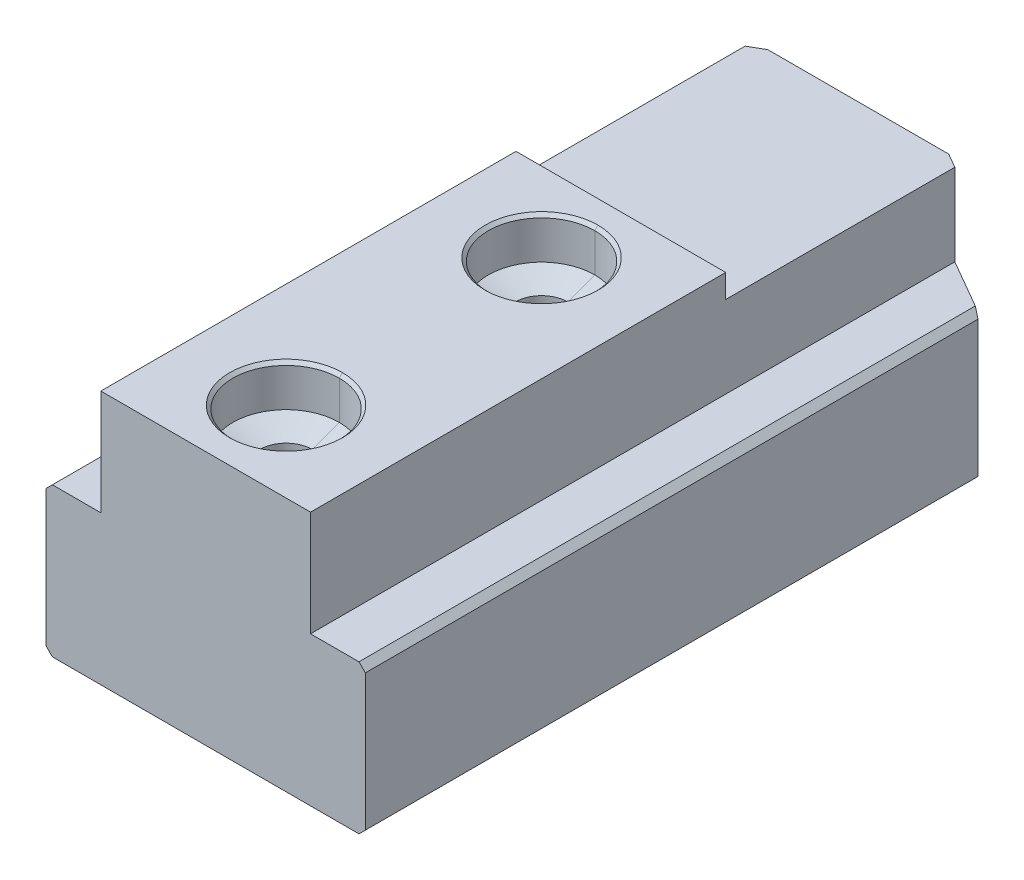
ISO-10303-21;
HEADER;
FILE_DESCRIPTION(('STEP AP214'),'2;1');
FILE_NAME('part.step','',(''),(''),'','','');
FILE_SCHEMA(('AUTOMOTIVE_DESIGN { 1 0 10303 214 1 1 1 1 }'));
ENDSEC;
DATA;
#1=APPLICATION_CONTEXT('core data for automotive mechanical design processes');
#2=APPLICATION_PROTOCOL_DEFINITION('international standard','automotive_design',2000,#1);
#3=PRODUCT_CONTEXT('',#1,'mechanical');
#4=PRODUCT('Part','Part','',(#3));
#5=PRODUCT_RELATED_PRODUCT_CATEGORY('part','',(#4));
#6=PRODUCT_DEFINITION_FORMATION('','',#4);
#7=PRODUCT_DEFINITION_CONTEXT('part definition',#1,'design');
#8=PRODUCT_DEFINITION('design','',#6,#7);
#9=PRODUCT_DEFINITION_SHAPE('','',#8);
#10=(LENGTH_UNIT() NAMED_UNIT(*) SI_UNIT(.MILLI.,.METRE.));
#11=(NAMED_UNIT(*) PLANE_ANGLE_UNIT() SI_UNIT($,.RADIAN.));
#12=(NAMED_UNIT(*) SI_UNIT($,.STERADIAN.) SOLID_ANGLE_UNIT());
#13=UNCERTAINTY_MEASURE_WITH_UNIT(LENGTH_MEASURE(1.E-05),#10,'distance_accuracy_value','');
#14=(GEOMETRIC_REPRESENTATION_CONTEXT(3) GLOBAL_UNCERTAINTY_ASSIGNED_CONTEXT((#13)) GLOBAL_UNIT_ASSIGNED_CONTEXT((#10,
#11,#12)) REPRESENTATION_CONTEXT('',''));
#15=CARTESIAN_POINT('',(0.,0.,0.));
#16=DIRECTION('',(0.,0.,1.));
#17=DIRECTION('',(1.,0.,0.));
#18=AXIS2_PLACEMENT_3D('',#15,#16,#17);
#19=CARTESIAN_POINT('',(0.,0.,0.));
#20=DIRECTION('',(0.,0.,1.));
#21=DIRECTION('',(1.,0.,0.));
#22=AXIS2_PLACEMENT_3D('',#19,#20,#21);
#23=PLANE('',#22);
#24=DIRECTION('',(0.,-1.,0.));
#25=VECTOR('',#24,1.);
#26=CARTESIAN_POINT('',(8.5,23.9,0.));
#27=LINE('',#26,#25);
#28=CARTESIAN_POINT('',(8.5,21.7,0.));
#29=VERTEX_POINT('',#28);
#30=CARTESIAN_POINT('',(8.5,0.,0.));
#31=VERTEX_POINT('',#30);
#32=EDGE_CURVE('E11',#29,#31,#27,.T.);
#33=ORIENTED_EDGE('',*,*,#32,.T.);
#34=DIRECTION('',(1.,0.,0.));
#35=VECTOR('',#34,1.);
#36=CARTESIAN_POINT('',(-14.4,0.,0.));
#37=LINE('',#36,#35);
#38=CARTESIAN_POINT('',(-8.5,0.,0.));
#39=VERTEX_POINT('',#38);
#40=EDGE_CURVE('E25',#39,#31,#37,.T.);
#41=ORIENTED_EDGE('',*,*,#40,.F.);
#42=DIRECTION('',(0.,-1.,0.));
#43=VECTOR('',#42,1.);
#44=CARTESIAN_POINT('',(-8.5,23.9,0.));
#45=LINE('',#44,#43);
#46=CARTESIAN_POINT('',(-8.5,21.7,0.));
#47=VERTEX_POINT('',#46);
#48=EDGE_CURVE('E615',#47,#39,#45,.T.);
#49=ORIENTED_EDGE('',*,*,#48,.F.);
#50=DIRECTION('',(-1.,0.,0.));
#51=VECTOR('',#50,1.);
#52=CARTESIAN_POINT('',(15.,21.7,0.));
#53=LINE('',#52,#51);
#54=EDGE_CURVE('E610',#29,#47,#53,.T.);
#55=ORIENTED_EDGE('',*,*,#54,.F.);
#56=EDGE_LOOP('',(#33,#41,#49,#55));
#57=FACE_BOUND('',#56,.T.);
#58=ADVANCED_FACE('F17',(#57),#23,.F.);
#59=CARTESIAN_POINT('',(0.,21.7,0.));
#60=DIRECTION('',(0.,1.,0.));
#61=DIRECTION('',(0.,0.,1.));
#62=AXIS2_PLACEMENT_3D('',#59,#60,#61);
#63=PLANE('',#62);
#64=DIRECTION('',(0.,0.,-1.));
#65=VECTOR('',#64,1.);
#66=CARTESIAN_POINT('',(9.85,21.7,61.3));
#67=LINE('',#66,#65);
#68=CARTESIAN_POINT('',(9.85,21.7,22.3));
#69=VERTEX_POINT('',#68);
#70=CARTESIAN_POINT('',(9.85,21.7,0.779422863406001));
#71=VERTEX_POINT('',#70);
#72=EDGE_CURVE('E606',#69,#71,#67,.T.);
#73=ORIENTED_EDGE('',*,*,#72,.T.);
#74=DIRECTION('',(-0.866025403784438,0.,-0.500000000000001));
#75=VECTOR('',#74,1.);
#76=CARTESIAN_POINT('',(2.12500000000003,21.7,-3.68060796608388));
#77=LINE('',#76,#75);
#78=EDGE_CURVE('E601',#71,#29,#77,.T.);
#79=ORIENTED_EDGE('',*,*,#78,.T.);
#80=ORIENTED_EDGE('',*,*,#54,.T.);
#81=DIRECTION('',(-0.866025403784438,0.,0.500000000000001));
#82=VECTOR('',#81,1.);
#83=CARTESIAN_POINT('',(-2.12500000000003,21.7,-3.68060796608388));
#84=LINE('',#83,#82);
#85=CARTESIAN_POINT('',(-9.85,21.7,0.77942286340601));
#86=VERTEX_POINT('',#85);
#87=EDGE_CURVE('E597',#47,#86,#84,.T.);
#88=ORIENTED_EDGE('',*,*,#87,.T.);
#89=DIRECTION('',(0.,0.,1.));
#90=VECTOR('',#89,1.);
#91=CARTESIAN_POINT('',(-9.85,21.7,61.3));
#92=LINE('',#91,#90);
#93=CARTESIAN_POINT('',(-9.85,21.7,22.3));
#94=VERTEX_POINT('',#93);
#95=EDGE_CURVE('E593',#86,#94,#92,.T.);
#96=ORIENTED_EDGE('',*,*,#95,.T.);
#97=DIRECTION('',(1.,0.,0.));
#98=VECTOR('',#97,1.);
#99=CARTESIAN_POINT('',(-15.,21.7,22.3));
#100=LINE('',#99,#98);
#101=EDGE_CURVE('E589',#94,#69,#100,.T.);
#102=ORIENTED_EDGE('',*,*,#101,.T.);
#103=EDGE_LOOP('',(#73,#79,#80,#88,#96,#102));
#104=FACE_BOUND('',#103,.T.);
#105=ADVANCED_FACE('F635',(#104),#63,.T.);
#106=CARTESIAN_POINT('',(-15.,21.7,22.3));
#107=DIRECTION('',(0.,0.,1.));
#108=DIRECTION('',(1.,0.,0.));
#109=AXIS2_PLACEMENT_3D('',#106,#107,#108);
#110=PLANE('',#109);
#111=ORIENTED_EDGE('',*,*,#101,.F.);
#112=DIRECTION('',(0.,-1.,0.));
#113=VECTOR('',#112,1.);
#114=CARTESIAN_POINT('',(-9.85,23.9,22.3));
#115=LINE('',#114,#113);
#116=CARTESIAN_POINT('',(-9.85,23.9,22.3));
#117=VERTEX_POINT('',#116);
#118=EDGE_CURVE('E584',#117,#94,#115,.T.);
#119=ORIENTED_EDGE('',*,*,#118,.F.);
#120=DIRECTION('',(1.,0.,0.));
#121=VECTOR('',#120,1.);
#122=CARTESIAN_POINT('',(-15.,23.9,22.3));
#123=LINE('',#122,#121);
#124=CARTESIAN_POINT('',(9.85,23.9,22.3));
#125=VERTEX_POINT('',#124);
#126=EDGE_CURVE('E580',#117,#125,#123,.T.);
#127=ORIENTED_EDGE('',*,*,#126,.T.);
#128=DIRECTION('',(0.,1.,0.));
#129=VECTOR('',#128,1.);
#130=CARTESIAN_POINT('',(9.85,14.,22.3));
#131=LINE('',#130,#129);
#132=EDGE_CURVE('E575',#69,#125,#131,.T.);
#133=ORIENTED_EDGE('',*,*,#132,.F.);
#134=EDGE_LOOP('',(#111,#119,#127,#133));
#135=FACE_BOUND('',#134,.T.);
#136=ADVANCED_FACE('F671',(#135),#110,.F.);
#137=CARTESIAN_POINT('',(9.85,14.,61.3));
#138=DIRECTION('',(-1.,0.,0.));
#139=DIRECTION('',(0.,0.,1.));
#140=AXIS2_PLACEMENT_3D('',#137,#138,#139);
#141=PLANE('',#140);
#142=DIRECTION('',(0.,-1.,0.));
#143=VECTOR('',#142,1.);
#144=CARTESIAN_POINT('',(9.85,14.,0.779422863406001));
#145=LINE('',#144,#143);
#146=CARTESIAN_POINT('',(9.85,14.,0.779422863406001));
#147=VERTEX_POINT('',#146);
#148=EDGE_CURVE('E570',#71,#147,#145,.T.);
#149=ORIENTED_EDGE('',*,*,#148,.F.);
#150=ORIENTED_EDGE('',*,*,#72,.F.);
#151=ORIENTED_EDGE('',*,*,#132,.T.);
#152=DIRECTION('',(0.,0.,-1.));
#153=VECTOR('',#152,1.);
#154=CARTESIAN_POINT('',(9.85,23.9,61.3));
#155=LINE('',#154,#153);
#156=CARTESIAN_POINT('',(9.85,23.9,61.3));
#157=VERTEX_POINT('',#156);
#158=EDGE_CURVE('E565',#157,#125,#155,.T.);
#159=ORIENTED_EDGE('',*,*,#158,.F.);
#160=DIRECTION('',(0.,1.,0.));
#161=VECTOR('',#160,1.);
#162=CARTESIAN_POINT('',(9.85,14.,61.3));
#163=LINE('',#162,#161);
#164=CARTESIAN_POINT('',(9.85,14.,61.3));
#165=VERTEX_POINT('',#164);
#166=EDGE_CURVE('E560',#165,#157,#163,.T.);
#167=ORIENTED_EDGE('',*,*,#166,.F.);
#168=DIRECTION('',(0.,0.,-1.));
#169=VECTOR('',#168,1.);
#170=CARTESIAN_POINT('',(9.85,14.,61.3));
#171=LINE('',#170,#169);
#172=EDGE_CURVE('E556',#165,#147,#171,.T.);
#173=ORIENTED_EDGE('',*,*,#172,.T.);
#174=EDGE_LOOP('',(#149,#150,#151,#159,#167,#173));
#175=FACE_BOUND('',#174,.T.);
#176=ADVANCED_FACE('F674',(#175),#141,.F.);
#177=CARTESIAN_POINT('',(14.4,14.,61.3));
#178=DIRECTION('',(0.,-1.,0.));
#179=DIRECTION('',(0.,0.,-1.));
#180=AXIS2_PLACEMENT_3D('',#177,#178,#179);
#181=PLANE('',#180);
#182=DIRECTION('',(0.866025403784438,0.,0.500000000000001));
#183=VECTOR('',#182,1.);
#184=CARTESIAN_POINT('',(39.4686786259932,14.,17.8797749411643));
#185=LINE('',#184,#183);
#186=CARTESIAN_POINT('',(14.4,14.,3.40636658821883));
#187=VERTEX_POINT('',#186);
#188=EDGE_CURVE('E551',#147,#187,#185,.T.);
#189=ORIENTED_EDGE('',*,*,#188,.F.);
#190=ORIENTED_EDGE('',*,*,#172,.F.);
#191=DIRECTION('',(-1.,0.,0.));
#192=VECTOR('',#191,1.);
#193=CARTESIAN_POINT('',(14.4,14.,61.3));
#194=LINE('',#193,#192);
#195=CARTESIAN_POINT('',(14.4,14.,61.3));
#196=VERTEX_POINT('',#195);
#197=EDGE_CURVE('E546',#196,#165,#194,.T.);
#198=ORIENTED_EDGE('',*,*,#197,.F.);
#199=DIRECTION('',(0.,0.,-1.));
#200=VECTOR('',#199,1.);
#201=CARTESIAN_POINT('',(14.4,14.,61.3));
#202=LINE('',#201,#200);
#203=EDGE_CURVE('E542',#196,#187,#202,.T.);
#204=ORIENTED_EDGE('',*,*,#203,.T.);
#205=EDGE_LOOP('',(#189,#190,#198,#204));
#206=FACE_BOUND('',#205,.T.);
#207=ADVANCED_FACE('F679',(#206),#181,.F.);
#208=CARTESIAN_POINT('',(15.,13.4,61.3));
#209=DIRECTION('',(-0.707106781186549,-0.707106781186547,0.));
#210=DIRECTION('',(0.707106781186547,-0.707106781186549,0.));
#211=AXIS2_PLACEMENT_3D('',#208,#209,#210);
#212=PLANE('',#211);
#213=DIRECTION('',(0.654653670707976,-0.654653670707977,0.377964473009229));
#214=VECTOR('',#213,1.);
#215=CARTESIAN_POINT('',(29.239244929139,-0.83924492913897,11.973808642628));
#216=LINE('',#215,#214);
#217=CARTESIAN_POINT('',(15.,13.4,3.7527767497326));
#218=VERTEX_POINT('',#217);
#219=EDGE_CURVE('E537',#187,#218,#216,.T.);
#220=ORIENTED_EDGE('',*,*,#219,.F.);
#221=ORIENTED_EDGE('',*,*,#203,.F.);
#222=DIRECTION('',(-0.707106781186547,0.707106781186549,0.));
#223=VECTOR('',#222,1.);
#224=CARTESIAN_POINT('',(15.,13.4,61.3));
#225=LINE('',#224,#223);
#226=CARTESIAN_POINT('',(15.,13.4,61.3));
#227=VERTEX_POINT('',#226);
#228=EDGE_CURVE('E532',#227,#196,#225,.T.);
#229=ORIENTED_EDGE('',*,*,#228,.F.);
#230=DIRECTION('',(0.,0.,-1.));
#231=VECTOR('',#230,1.);
#232=CARTESIAN_POINT('',(15.,13.4,61.3));
#233=LINE('',#232,#231);
#234=EDGE_CURVE('E528',#227,#218,#233,.T.);
#235=ORIENTED_EDGE('',*,*,#234,.T.);
#236=EDGE_LOOP('',(#220,#221,#229,#235));
#237=FACE_BOUND('',#236,.T.);
#238=ADVANCED_FACE('F682',(#237),#212,.F.);
#239=CARTESIAN_POINT('',(15.,0.6,61.3));
#240=DIRECTION('',(-1.,0.,0.));
#241=DIRECTION('',(0.,0.,1.));
#242=AXIS2_PLACEMENT_3D('',#239,#240,#241);
#243=PLANE('',#242);
#244=DIRECTION('',(0.,-1.,0.));
#245=VECTOR('',#244,1.);
#246=CARTESIAN_POINT('',(15.,23.9,3.7527767497326));
#247=LINE('',#246,#245);
#248=CARTESIAN_POINT('',(15.,0.600000000000007,3.7527767497326));
#249=VERTEX_POINT('',#248);
#250=EDGE_CURVE('E523',#218,#249,#247,.T.);
#251=ORIENTED_EDGE('',*,*,#250,.F.);
#252=ORIENTED_EDGE('',*,*,#234,.F.);
#253=DIRECTION('',(0.,1.,0.));
#254=VECTOR('',#253,1.);
#255=CARTESIAN_POINT('',(15.,0.6,61.3));
#256=LINE('',#255,#254);
#257=CARTESIAN_POINT('',(15.,0.6,61.3));
#258=VERTEX_POINT('',#257);
#259=EDGE_CURVE('E518',#258,#227,#256,.T.);
#260=ORIENTED_EDGE('',*,*,#259,.F.);
#261=DIRECTION('',(0.,0.,-1.));
#262=VECTOR('',#261,1.);
#263=CARTESIAN_POINT('',(15.,0.6,61.3));
#264=LINE('',#263,#262);
#265=EDGE_CURVE('E514',#258,#249,#264,.T.);
#266=ORIENTED_EDGE('',*,*,#265,.T.);
#267=EDGE_LOOP('',(#251,#252,#260,#266));
#268=FACE_BOUND('',#267,.T.);
#269=ADVANCED_FACE('F685',(#268),#243,.F.);
#270=CARTESIAN_POINT('',(14.4,0.,61.3));
#271=DIRECTION('',(-0.707106781186549,0.707106781186547,0.));
#272=DIRECTION('',(-0.707106781186547,-0.707106781186549,0.));
#273=AXIS2_PLACEMENT_3D('',#270,#271,#272);
#274=PLANE('',#273);
#275=DIRECTION('',(-0.654653670707975,-0.654653670707977,-0.37796447300923));
#276=VECTOR('',#275,1.);
#277=CARTESIAN_POINT('',(28.7249592148532,14.3249592148533,11.6768856470448));
#278=LINE('',#277,#276);
#279=CARTESIAN_POINT('',(14.4,0.,3.40636658821882));
#280=VERTEX_POINT('',#279);
#281=EDGE_CURVE('E509',#249,#280,#278,.T.);
#282=ORIENTED_EDGE('',*,*,#281,.F.);
#283=ORIENTED_EDGE('',*,*,#265,.F.);
#284=DIRECTION('',(0.707106781186547,0.707106781186549,0.));
#285=VECTOR('',#284,1.);
#286=CARTESIAN_POINT('',(14.4,0.,61.3));
#287=LINE('',#286,#285);
#288=CARTESIAN_POINT('',(14.4,0.,61.3));
#289=VERTEX_POINT('',#288);
#290=EDGE_CURVE('E504',#289,#258,#287,.T.);
#291=ORIENTED_EDGE('',*,*,#290,.F.);
#292=DIRECTION('',(0.,0.,-1.));
#293=VECTOR('',#292,1.);
#294=CARTESIAN_POINT('',(14.4,0.,61.3));
#295=LINE('',#294,#293);
#296=EDGE_CURVE('E500',#289,#280,#295,.T.);
#297=ORIENTED_EDGE('',*,*,#296,.T.);
#298=EDGE_LOOP('',(#282,#283,#291,#297));
#299=FACE_BOUND('',#298,.T.);
#300=ADVANCED_FACE('F644',(#299),#274,.F.);
#301=CARTESIAN_POINT('',(-14.4,0.,61.3));
#302=DIRECTION('',(0.,1.,0.));
#303=DIRECTION('',(0.,0.,1.));
#304=AXIS2_PLACEMENT_3D('',#301,#302,#303);
#305=PLANE('',#304);
#306=DIRECTION('',(0.866025403784438,0.,0.500000000000001));
#307=VECTOR('',#306,1.);
#308=CARTESIAN_POINT('',(8.5,0.,0.));
#309=LINE('',#308,#307);
#310=EDGE_CURVE('E495',#31,#280,#309,.T.);
#311=ORIENTED_EDGE('',*,*,#310,.T.);
#312=ORIENTED_EDGE('',*,*,#296,.F.);
#313=DIRECTION('',(1.,0.,0.));
#314=VECTOR('',#313,1.);
#315=CARTESIAN_POINT('',(-14.4,0.,61.3));
#316=LINE('',#315,#314);
#317=CARTESIAN_POINT('',(-14.4,0.,61.3));
#318=VERTEX_POINT('',#317);
#319=EDGE_CURVE('E490',#318,#289,#316,.T.);
#320=ORIENTED_EDGE('',*,*,#319,.F.);
#321=DIRECTION('',(0.,0.,-1.));
#322=VECTOR('',#321,1.);
#323=CARTESIAN_POINT('',(-14.4,0.,61.3));
#324=LINE('',#323,#322);
#325=CARTESIAN_POINT('',(-14.4,0.,3.40636658821882));
#326=VERTEX_POINT('',#325);
#327=EDGE_CURVE('E486',#318,#326,#324,.T.);
#328=ORIENTED_EDGE('',*,*,#327,.T.);
#329=DIRECTION('',(0.866025403784438,0.,-0.500000000000001));
#330=VECTOR('',#329,1.);
#331=CARTESIAN_POINT('',(-15.,0.,3.7527767497326));
#332=LINE('',#331,#330);
#333=EDGE_CURVE('E482',#326,#39,#332,.T.);
#334=ORIENTED_EDGE('',*,*,#333,.T.);
#335=ORIENTED_EDGE('',*,*,#40,.T.);
#336=EDGE_LOOP('',(#311,#312,#320,#328,#334,#335));
#337=FACE_BOUND('',#336,.T.);
#338=ADVANCED_FACE('F625',(#337),#305,.F.);
#339=CARTESIAN_POINT('',(-15.,23.9,3.7527767497326));
#340=DIRECTION('',(-0.500000000000001,0.,-0.866025403784438));
#341=DIRECTION('',(-0.866025403784438,0.,0.500000000000001));
#342=AXIS2_PLACEMENT_3D('',#339,#340,#341);
#343=PLANE('',#342);
#344=DIRECTION('',(-0.654653670707975,0.654653670707977,0.37796447300923));
#345=VECTOR('',#344,1.);
#346=CARTESIAN_POINT('',(-29.239244929139,14.839244929139,11.973808642628));
#347=LINE('',#346,#345);
#348=CARTESIAN_POINT('',(-15.,0.6,3.7527767497326));
#349=VERTEX_POINT('',#348);
#350=EDGE_CURVE('E478',#326,#349,#347,.T.);
#351=ORIENTED_EDGE('',*,*,#350,.T.);
#352=DIRECTION('',(0.,-1.,0.));
#353=VECTOR('',#352,1.);
#354=CARTESIAN_POINT('',(-15.,23.9,3.7527767497326));
#355=LINE('',#354,#353);
#356=CARTESIAN_POINT('',(-15.,13.4,3.7527767497326));
#357=VERTEX_POINT('',#356);
#358=EDGE_CURVE('E473',#357,#349,#355,.T.);
#359=ORIENTED_EDGE('',*,*,#358,.F.);
#360=DIRECTION('',(0.654653670707976,0.654653670707977,-0.377964473009229));
#361=VECTOR('',#360,1.);
#362=CARTESIAN_POINT('',(-28.7249592148532,-0.324959214853256,11.6768856470448));
#363=LINE('',#362,#361);
#364=CARTESIAN_POINT('',(-14.4,14.,3.40636658821883));
#365=VERTEX_POINT('',#364);
#366=EDGE_CURVE('E469',#357,#365,#363,.T.);
#367=ORIENTED_EDGE('',*,*,#366,.T.);
#368=DIRECTION('',(0.866025403784438,0.,-0.500000000000001));
#369=VECTOR('',#368,1.);
#370=CARTESIAN_POINT('',(-36.0561786259931,14.,15.9095671475547));
#371=LINE('',#370,#369);
#372=CARTESIAN_POINT('',(-9.85,14.,0.779422863406008));
#373=VERTEX_POINT('',#372);
#374=EDGE_CURVE('E465',#365,#373,#371,.T.);
#375=ORIENTED_EDGE('',*,*,#374,.T.);
#376=DIRECTION('',(0.,1.,0.));
#377=VECTOR('',#376,1.);
#378=CARTESIAN_POINT('',(-9.85,23.9,0.779422863406008));
#379=LINE('',#378,#377);
#380=EDGE_CURVE('E460',#373,#86,#379,.T.);
#381=ORIENTED_EDGE('',*,*,#380,.T.);
#382=ORIENTED_EDGE('',*,*,#87,.F.);
#383=ORIENTED_EDGE('',*,*,#48,.T.);
#384=ORIENTED_EDGE('',*,*,#333,.F.);
#385=EDGE_LOOP('',(#351,#359,#367,#375,#381,#382,#383,#384));
#386=FACE_BOUND('',#385,.T.);
#387=ADVANCED_FACE('F632',(#386),#343,.T.);
#388=CARTESIAN_POINT('',(-9.85,23.9,61.3));
#389=DIRECTION('',(1.,0.,0.));
#390=DIRECTION('',(0.,0.,-1.));
#391=AXIS2_PLACEMENT_3D('',#388,#389,#390);
#392=PLANE('',#391);
#393=ORIENTED_EDGE('',*,*,#380,.F.);
#394=DIRECTION('',(0.,0.,-1.));
#395=VECTOR('',#394,1.);
#396=CARTESIAN_POINT('',(-9.85,14.,61.3));
#397=LINE('',#396,#395);
#398=CARTESIAN_POINT('',(-9.85,14.,61.3));
#399=VERTEX_POINT('',#398);
#400=EDGE_CURVE('E455',#399,#373,#397,.T.);
#401=ORIENTED_EDGE('',*,*,#400,.F.);
#402=DIRECTION('',(0.,-1.,0.));
#403=VECTOR('',#402,1.);
#404=CARTESIAN_POINT('',(-9.85,23.9,61.3));
#405=LINE('',#404,#403);
#406=CARTESIAN_POINT('',(-9.85,23.9,61.3));
#407=VERTEX_POINT('',#406);
#408=EDGE_CURVE('E450',#407,#399,#405,.T.);
#409=ORIENTED_EDGE('',*,*,#408,.F.);
#410=DIRECTION('',(0.,0.,-1.));
#411=VECTOR('',#410,1.);
#412=CARTESIAN_POINT('',(-9.85,23.9,61.3));
#413=LINE('',#412,#411);
#414=EDGE_CURVE('E445',#407,#117,#413,.T.);
#415=ORIENTED_EDGE('',*,*,#414,.T.);
#416=ORIENTED_EDGE('',*,*,#118,.T.);
#417=ORIENTED_EDGE('',*,*,#95,.F.);
#418=EDGE_LOOP('',(#393,#401,#409,#415,#416,#417));
#419=FACE_BOUND('',#418,.T.);
#420=ADVANCED_FACE('F667',(#419),#392,.F.);
#421=CARTESIAN_POINT('',(9.85,23.9,61.3));
#422=DIRECTION('',(0.,-1.,0.));
#423=DIRECTION('',(0.,0.,-1.));
#424=AXIS2_PLACEMENT_3D('',#421,#422,#423);
#425=PLANE('',#424);
#426=CARTESIAN_POINT('',(0.,23.9,29.75));
#427=DIRECTION('',(0.,-1.,0.));
#428=DIRECTION('',(0.,0.,-1.));
#429=AXIS2_PLACEMENT_3D('',#426,#427,#428);
#430=CIRCLE('',#429,5.3);
#431=CARTESIAN_POINT('',(0.,23.9,24.45));
#432=VERTEX_POINT('',#431);
#433=CARTESIAN_POINT('',(0.,23.9,35.05));
#434=VERTEX_POINT('',#433);
#435=EDGE_CURVE('E441',#432,#434,#430,.T.);
#436=ORIENTED_EDGE('',*,*,#435,.T.);
#437=CARTESIAN_POINT('',(0.,23.9,29.75));
#438=DIRECTION('',(0.,-1.,0.));
#439=DIRECTION('',(0.,0.,-1.));
#440=AXIS2_PLACEMENT_3D('',#437,#438,#439);
#441=CIRCLE('',#440,5.3);
#442=EDGE_CURVE('E437',#434,#432,#441,.T.);
#443=ORIENTED_EDGE('',*,*,#442,.T.);
#444=EDGE_LOOP('',(#436,#443));
#445=FACE_BOUND('',#444,.T.);
#446=CARTESIAN_POINT('',(0.,23.9,53.75));
#447=DIRECTION('',(0.,-1.,0.));
#448=DIRECTION('',(0.,0.,-1.));
#449=AXIS2_PLACEMENT_3D('',#446,#447,#448);
#450=CIRCLE('',#449,5.3);
#451=CARTESIAN_POINT('',(0.,23.9,48.45));
#452=VERTEX_POINT('',#451);
#453=CARTESIAN_POINT('',(0.,23.9,59.05));
#454=VERTEX_POINT('',#453);
#455=EDGE_CURVE('E433',#452,#454,#450,.T.);
#456=ORIENTED_EDGE('',*,*,#455,.T.);
#457=CARTESIAN_POINT('',(0.,23.9,53.75));
#458=DIRECTION('',(0.,-1.,0.));
#459=DIRECTION('',(0.,0.,-1.));
#460=AXIS2_PLACEMENT_3D('',#457,#458,#459);
#461=CIRCLE('',#460,5.3);
#462=EDGE_CURVE('E429',#454,#452,#461,.T.);
#463=ORIENTED_EDGE('',*,*,#462,.T.);
#464=EDGE_LOOP('',(#456,#463));
#465=FACE_BOUND('',#464,.T.);
#466=ORIENTED_EDGE('',*,*,#158,.T.);
#467=ORIENTED_EDGE('',*,*,#126,.F.);
#468=ORIENTED_EDGE('',*,*,#414,.F.);
#469=DIRECTION('',(-1.,0.,0.));
#470=VECTOR('',#469,1.);
#471=CARTESIAN_POINT('',(9.85,23.9,61.3));
#472=LINE('',#471,#470);
#473=EDGE_CURVE('E424',#157,#407,#472,.T.);
#474=ORIENTED_EDGE('',*,*,#473,.F.);
#475=EDGE_LOOP('',(#466,#467,#468,#474));
#476=FACE_BOUND('',#475,.T.);
#477=ADVANCED_FACE('F689',(#445,#465,#476),#425,.F.);
#478=CARTESIAN_POINT('',(0.,0.,61.3));
#479=DIRECTION('',(0.,0.,1.));
#480=DIRECTION('',(1.,0.,0.));
#481=AXIS2_PLACEMENT_3D('',#478,#479,#480);
#482=PLANE('',#481);
#483=DIRECTION('',(-0.707106781186547,-0.707106781186549,0.));
#484=VECTOR('',#483,1.);
#485=CARTESIAN_POINT('',(-14.4,14.,61.3));
#486=LINE('',#485,#484);
#487=CARTESIAN_POINT('',(-14.4,14.,61.3));
#488=VERTEX_POINT('',#487);
#489=CARTESIAN_POINT('',(-15.,13.4,61.3));
#490=VERTEX_POINT('',#489);
#491=EDGE_CURVE('E420',#488,#490,#486,.T.);
#492=ORIENTED_EDGE('',*,*,#491,.T.);
#493=DIRECTION('',(0.,-1.,0.));
#494=VECTOR('',#493,1.);
#495=CARTESIAN_POINT('',(-15.,13.4,61.3));
#496=LINE('',#495,#494);
#497=CARTESIAN_POINT('',(-15.,0.6,61.3));
#498=VERTEX_POINT('',#497);
#499=EDGE_CURVE('E416',#490,#498,#496,.T.);
#500=ORIENTED_EDGE('',*,*,#499,.T.);
#501=DIRECTION('',(0.707106781186547,-0.707106781186549,0.));
#502=VECTOR('',#501,1.);
#503=CARTESIAN_POINT('',(-15.,0.6,61.3));
#504=LINE('',#503,#502);
#505=EDGE_CURVE('E411',#498,#318,#504,.T.);
#506=ORIENTED_EDGE('',*,*,#505,.T.);
#507=ORIENTED_EDGE('',*,*,#319,.T.);
#508=ORIENTED_EDGE('',*,*,#290,.T.);
#509=ORIENTED_EDGE('',*,*,#259,.T.);
#510=ORIENTED_EDGE('',*,*,#228,.T.);
#511=ORIENTED_EDGE('',*,*,#197,.T.);
#512=ORIENTED_EDGE('',*,*,#166,.T.);
#513=ORIENTED_EDGE('',*,*,#473,.T.);
#514=ORIENTED_EDGE('',*,*,#408,.T.);
#515=DIRECTION('',(-1.,0.,0.));
#516=VECTOR('',#515,1.);
#517=CARTESIAN_POINT('',(-9.85,14.,61.3));
#518=LINE('',#517,#516);
#519=EDGE_CURVE('E407',#399,#488,#518,.T.);
#520=ORIENTED_EDGE('',*,*,#519,.T.);
#521=EDGE_LOOP('',(#492,#500,#506,#507,#508,#509,#510,#511,#512,#513,#514,#520));
#522=FACE_BOUND('',#521,.T.);
#523=ADVANCED_FACE('F647',(#522),#482,.T.);
#524=CARTESIAN_POINT('',(-9.85,14.,61.3));
#525=DIRECTION('',(0.,-1.,0.));
#526=DIRECTION('',(0.,0.,-1.));
#527=AXIS2_PLACEMENT_3D('',#524,#525,#526);
#528=PLANE('',#527);
#529=ORIENTED_EDGE('',*,*,#374,.F.);
#530=DIRECTION('',(0.,0.,-1.));
#531=VECTOR('',#530,1.);
#532=CARTESIAN_POINT('',(-14.4,14.,61.3));
#533=LINE('',#532,#531);
#534=EDGE_CURVE('E402',#488,#365,#533,.T.);
#535=ORIENTED_EDGE('',*,*,#534,.F.);
#536=ORIENTED_EDGE('',*,*,#519,.F.);
#537=ORIENTED_EDGE('',*,*,#400,.T.);
#538=EDGE_LOOP('',(#529,#535,#536,#537));
#539=FACE_BOUND('',#538,.T.);
#540=ADVANCED_FACE('F663',(#539),#528,.F.);
#541=CARTESIAN_POINT('',(-14.4,14.,61.3));
#542=DIRECTION('',(0.707106781186549,-0.707106781186547,0.));
#543=DIRECTION('',(0.707106781186547,0.707106781186549,0.));
#544=AXIS2_PLACEMENT_3D('',#541,#542,#543);
#545=PLANE('',#544);
#546=ORIENTED_EDGE('',*,*,#366,.F.);
#547=DIRECTION('',(0.,0.,-1.));
#548=VECTOR('',#547,1.);
#549=CARTESIAN_POINT('',(-15.,13.4,61.3));
#550=LINE('',#549,#548);
#551=EDGE_CURVE('E397',#490,#357,#550,.T.);
#552=ORIENTED_EDGE('',*,*,#551,.F.);
#553=ORIENTED_EDGE('',*,*,#491,.F.);
#554=ORIENTED_EDGE('',*,*,#534,.T.);
#555=EDGE_LOOP('',(#546,#552,#553,#554));
#556=FACE_BOUND('',#555,.T.);
#557=ADVANCED_FACE('F658',(#556),#545,.F.);
#558=CARTESIAN_POINT('',(-15.,13.4,61.3));
#559=DIRECTION('',(1.,0.,0.));
#560=DIRECTION('',(0.,0.,-1.));
#561=AXIS2_PLACEMENT_3D('',#558,#559,#560);
#562=PLANE('',#561);
#563=ORIENTED_EDGE('',*,*,#358,.T.);
#564=DIRECTION('',(0.,0.,-1.));
#565=VECTOR('',#564,1.);
#566=CARTESIAN_POINT('',(-15.,0.6,61.3));
#567=LINE('',#566,#565);
#568=EDGE_CURVE('E392',#498,#349,#567,.T.);
#569=ORIENTED_EDGE('',*,*,#568,.F.);
#570=ORIENTED_EDGE('',*,*,#499,.F.);
#571=ORIENTED_EDGE('',*,*,#551,.T.);
#572=EDGE_LOOP('',(#563,#569,#570,#571));
#573=FACE_BOUND('',#572,.T.);
#574=ADVANCED_FACE('F655',(#573),#562,.F.);
#575=CARTESIAN_POINT('',(-15.,0.6,61.3));
#576=DIRECTION('',(0.707106781186549,0.707106781186547,0.));
#577=DIRECTION('',(-0.707106781186547,0.707106781186549,0.));
#578=AXIS2_PLACEMENT_3D('',#575,#576,#577);
#579=PLANE('',#578);
#580=ORIENTED_EDGE('',*,*,#350,.F.);
#581=ORIENTED_EDGE('',*,*,#327,.F.);
#582=ORIENTED_EDGE('',*,*,#505,.F.);
#583=ORIENTED_EDGE('',*,*,#568,.T.);
#584=EDGE_LOOP('',(#580,#581,#582,#583));
#585=FACE_BOUND('',#584,.T.);
#586=ADVANCED_FACE('F651',(#585),#579,.F.);
#587=CARTESIAN_POINT('',(0.,23.9,53.75));
#588=DIRECTION('',(0.,1.,0.));
#589=DIRECTION('',(1.,0.,0.));
#590=AXIS2_PLACEMENT_3D('',#587,#588,#589);
#591=CONICAL_SURFACE('',#590,5.3,0.785398163397448);
#592=DIRECTION('',(0.,0.707106781186548,-0.707106781186548));
#593=VECTOR('',#592,1.);
#594=CARTESIAN_POINT('',(0.,23.6,48.75));
#595=LINE('',#594,#593);
#596=CARTESIAN_POINT('',(0.,23.6,48.75));
#597=VERTEX_POINT('',#596);
#598=EDGE_CURVE('E387',#597,#452,#595,.T.);
#599=ORIENTED_EDGE('',*,*,#598,.T.);
#600=ORIENTED_EDGE('',*,*,#462,.F.);
#601=DIRECTION('',(0.,0.707106781186548,0.707106781186548));
#602=VECTOR('',#601,1.);
#603=CARTESIAN_POINT('',(0.,23.6,58.75));
#604=LINE('',#603,#602);
#605=CARTESIAN_POINT('',(0.,23.6,58.75));
#606=VERTEX_POINT('',#605);
#607=EDGE_CURVE('E382',#606,#454,#604,.T.);
#608=ORIENTED_EDGE('',*,*,#607,.F.);
#609=CARTESIAN_POINT('',(0.,23.6,53.75));
#610=DIRECTION('',(0.,-1.,0.));
#611=DIRECTION('',(0.,0.,-1.));
#612=AXIS2_PLACEMENT_3D('',#609,#610,#611);
#613=CIRCLE('',#612,5.);
#614=EDGE_CURVE('E378',#606,#597,#613,.T.);
#615=ORIENTED_EDGE('',*,*,#614,.T.);
#616=EDGE_LOOP('',(#599,#600,#608,#615));
#617=FACE_BOUND('',#616,.T.);
#618=ADVANCED_FACE('F785',(#617),#591,.F.);
#619=CARTESIAN_POINT('',(0.,2.1974181429173,53.75));
#620=DIRECTION('',(0.,-1.,0.));
#621=DIRECTION('',(1.,0.,0.));
#622=AXIS2_PLACEMENT_3D('',#619,#620,#621);
#623=CYLINDRICAL_SURFACE('',#622,5.);
#624=DIRECTION('',(0.,-1.,0.));
#625=VECTOR('',#624,1.);
#626=CARTESIAN_POINT('',(0.,23.6,58.75));
#627=LINE('',#626,#625);
#628=CARTESIAN_POINT('',(0.,20.,58.75));
#629=VERTEX_POINT('',#628);
#630=EDGE_CURVE('E374',#606,#629,#627,.T.);
#631=ORIENTED_EDGE('',*,*,#630,.T.);
#632=CARTESIAN_POINT('',(0.,20.,53.75));
#633=DIRECTION('',(0.,-1.,0.));
#634=DIRECTION('',(0.,0.,-1.));
#635=AXIS2_PLACEMENT_3D('',#632,#633,#634);
#636=CIRCLE('',#635,5.);
#637=CARTESIAN_POINT('',(0.,20.,48.75));
#638=VERTEX_POINT('',#637);
#639=EDGE_CURVE('E370',#629,#638,#636,.T.);
#640=ORIENTED_EDGE('',*,*,#639,.T.);
#641=DIRECTION('',(0.,-1.,0.));
#642=VECTOR('',#641,1.);
#643=CARTESIAN_POINT('',(0.,23.6,48.75));
#644=LINE('',#643,#642);
#645=EDGE_CURVE('E365',#597,#638,#644,.T.);
#646=ORIENTED_EDGE('',*,*,#645,.F.);
#647=ORIENTED_EDGE('',*,*,#614,.F.);
#648=EDGE_LOOP('',(#631,#640,#646,#647));
#649=FACE_BOUND('',#648,.T.);
#650=ADVANCED_FACE('F795',(#649),#623,.F.);
#651=CARTESIAN_POINT('',(0.,2.1974181429173,53.75));
#652=DIRECTION('',(0.,-1.,0.));
#653=DIRECTION('',(-1.,0.,0.));
#654=AXIS2_PLACEMENT_3D('',#651,#652,#653);
#655=CYLINDRICAL_SURFACE('',#654,5.);
#656=ORIENTED_EDGE('',*,*,#630,.F.);
#657=CARTESIAN_POINT('',(0.,23.6,53.75));
#658=DIRECTION('',(0.,-1.,0.));
#659=DIRECTION('',(0.,0.,-1.));
#660=AXIS2_PLACEMENT_3D('',#657,#658,#659);
#661=CIRCLE('',#660,5.);
#662=EDGE_CURVE('E360',#597,#606,#661,.T.);
#663=ORIENTED_EDGE('',*,*,#662,.F.);
#664=ORIENTED_EDGE('',*,*,#645,.T.);
#665=CARTESIAN_POINT('',(0.,20.,53.75));
#666=DIRECTION('',(0.,-1.,0.));
#667=DIRECTION('',(0.,0.,-1.));
#668=AXIS2_PLACEMENT_3D('',#665,#666,#667);
#669=CIRCLE('',#668,5.);
#670=EDGE_CURVE('E355',#638,#629,#669,.T.);
#671=ORIENTED_EDGE('',*,*,#670,.T.);
#672=EDGE_LOOP('',(#656,#663,#664,#671));
#673=FACE_BOUND('',#672,.T.);
#674=ADVANCED_FACE('F806',(#673),#655,.F.);
#675=CARTESIAN_POINT('',(0.,20.,53.75));
#676=DIRECTION('',(0.,1.,0.));
#677=DIRECTION('',(-1.,0.,0.));
#678=AXIS2_PLACEMENT_3D('',#675,#676,#677);
#679=CONICAL_SURFACE('',#678,5.,1.22173047639587);
#680=DIRECTION('',(0.,0.342020143325816,-0.939692620785855));
#681=VECTOR('',#680,1.);
#682=CARTESIAN_POINT('',(0.,19.074969649612,51.2915));
#683=LINE('',#682,#681);
#684=CARTESIAN_POINT('',(0.,19.074969649612,51.2915));
#685=VERTEX_POINT('',#684);
#686=EDGE_CURVE('E350',#685,#638,#683,.T.);
#687=ORIENTED_EDGE('',*,*,#686,.F.);
#688=CARTESIAN_POINT('',(0.,19.074969649612,53.75));
#689=DIRECTION('',(0.,-1.,0.));
#690=DIRECTION('',(0.,0.,-1.));
#691=AXIS2_PLACEMENT_3D('',#688,#689,#690);
#692=CIRCLE('',#691,2.4585);
#693=CARTESIAN_POINT('',(0.,19.074969649612,56.2085));
#694=VERTEX_POINT('',#693);
#695=EDGE_CURVE('E346',#685,#694,#692,.T.);
#696=ORIENTED_EDGE('',*,*,#695,.T.);
#697=DIRECTION('',(0.,0.342020143325816,0.939692620785855));
#698=VECTOR('',#697,1.);
#699=CARTESIAN_POINT('',(0.,19.074969649612,56.2085));
#700=LINE('',#699,#698);
#701=EDGE_CURVE('E341',#694,#629,#700,.T.);
#702=ORIENTED_EDGE('',*,*,#701,.T.);
#703=ORIENTED_EDGE('',*,*,#670,.F.);
#704=EDGE_LOOP('',(#687,#696,#702,#703));
#705=FACE_BOUND('',#704,.T.);
#706=ADVANCED_FACE('F817',(#705),#679,.F.);
#707=CARTESIAN_POINT('',(0.,20.,53.75));
#708=DIRECTION('',(0.,1.,0.));
#709=DIRECTION('',(1.,0.,0.));
#710=AXIS2_PLACEMENT_3D('',#707,#708,#709);
#711=CONICAL_SURFACE('',#710,5.,1.22173047639587);
#712=ORIENTED_EDGE('',*,*,#686,.T.);
#713=ORIENTED_EDGE('',*,*,#639,.F.);
#714=ORIENTED_EDGE('',*,*,#701,.F.);
#715=CARTESIAN_POINT('',(0.,19.074969649612,53.75));
#716=DIRECTION('',(0.,-1.,0.));
#717=DIRECTION('',(0.,0.,-1.));
#718=AXIS2_PLACEMENT_3D('',#715,#716,#717);
#719=CIRCLE('',#718,2.4585);
#720=CARTESIAN_POINT('',(-0.759718280670809,19.074969649612,56.0881724453116));
#721=VERTEX_POINT('',#720);
#722=EDGE_CURVE('E337',#694,#721,#719,.T.);
#723=ORIENTED_EDGE('',*,*,#722,.T.);
#724=CARTESIAN_POINT('',(0.,19.074969649612,53.75));
#725=DIRECTION('',(0.,-1.,0.));
#726=DIRECTION('',(0.,0.,-1.));
#727=AXIS2_PLACEMENT_3D('',#724,#725,#726);
#728=CIRCLE('',#727,2.4585);
#729=EDGE_CURVE('E332',#721,#685,#728,.T.);
#730=ORIENTED_EDGE('',*,*,#729,.T.);
#731=EDGE_LOOP('',(#712,#713,#714,#723,#730));
#732=FACE_BOUND('',#731,.T.);
#733=ADVANCED_FACE('F828',(#732),#711,.F.);
#734=CARTESIAN_POINT('',(0.,2.1974181429173,53.75));
#735=DIRECTION('',(0.,-1.,0.));
#736=DIRECTION('',(0.987688340595138,0.,0.156434465040231));
#737=AXIS2_PLACEMENT_3D('',#734,#735,#736);
#738=CYLINDRICAL_SURFACE('',#737,2.4585);
#739=DIRECTION('',(0.,-1.,0.));
#740=VECTOR('',#739,1.);
#741=CARTESIAN_POINT('',(-0.759718280670809,19.074969649612,56.0881724453116));
#742=LINE('',#741,#740);
#743=CARTESIAN_POINT('',(-0.759718280670809,3.6746339747966,56.0881724453116));
#744=VERTEX_POINT('',#743);
#745=EDGE_CURVE('E328',#721,#744,#742,.T.);
#746=ORIENTED_EDGE('',*,*,#745,.T.);
#747=CARTESIAN_POINT('',(0.,3.6746339747966,53.75));
#748=DIRECTION('',(0.,-1.,0.));
#749=DIRECTION('',(0.,0.,-1.));
#750=AXIS2_PLACEMENT_3D('',#747,#748,#749);
#751=CIRCLE('',#750,2.4585);
#752=CARTESIAN_POINT('',(0.,3.6746339747966,51.2915));
#753=VERTEX_POINT('',#752);
#754=EDGE_CURVE('E324',#744,#753,#751,.T.);
#755=ORIENTED_EDGE('',*,*,#754,.T.);
#756=DIRECTION('',(0.,-1.,0.));
#757=VECTOR('',#756,1.);
#758=CARTESIAN_POINT('',(0.,19.074969649612,51.2915));
#759=LINE('',#758,#757);
#760=EDGE_CURVE('E319',#685,#753,#759,.T.);
#761=ORIENTED_EDGE('',*,*,#760,.F.);
#762=ORIENTED_EDGE('',*,*,#729,.F.);
#763=EDGE_LOOP('',(#746,#755,#761,#762));
#764=FACE_BOUND('',#763,.T.);
#765=ADVANCED_FACE('F839',(#764),#738,.F.);
#766=CARTESIAN_POINT('',(0.,2.1974181429173,53.75));
#767=DIRECTION('',(0.,-1.,0.));
#768=DIRECTION('',(-0.987688340595138,0.,-0.156434465040231));
#769=AXIS2_PLACEMENT_3D('',#766,#767,#768);
#770=CYLINDRICAL_SURFACE('',#769,2.4585);
#771=ORIENTED_EDGE('',*,*,#745,.F.);
#772=ORIENTED_EDGE('',*,*,#722,.F.);
#773=ORIENTED_EDGE('',*,*,#695,.F.);
#774=ORIENTED_EDGE('',*,*,#760,.T.);
#775=CARTESIAN_POINT('',(0.,3.6746339747966,53.75));
#776=DIRECTION('',(0.,-1.,0.));
#777=DIRECTION('',(0.,0.,-1.));
#778=AXIS2_PLACEMENT_3D('',#775,#776,#777);
#779=CIRCLE('',#778,2.4585);
#780=CARTESIAN_POINT('',(0.,3.6746339747966,56.2085));
#781=VERTEX_POINT('',#780);
#782=EDGE_CURVE('E315',#753,#781,#779,.T.);
#783=ORIENTED_EDGE('',*,*,#782,.T.);
#784=CARTESIAN_POINT('',(0.,3.6746339747966,53.75));
#785=DIRECTION('',(0.,-1.,0.));
#786=DIRECTION('',(0.,0.,-1.));
#787=AXIS2_PLACEMENT_3D('',#784,#785,#786);
#788=CIRCLE('',#787,2.4585);
#789=EDGE_CURVE('E310',#781,#744,#788,.T.);
#790=ORIENTED_EDGE('',*,*,#789,.T.);
#791=EDGE_LOOP('',(#771,#772,#773,#774,#783,#790));
#792=FACE_BOUND('',#791,.T.);
#793=ADVANCED_FACE('F850',(#792),#770,.F.);
#794=CARTESIAN_POINT('',(0.,3.6746339747966,53.75));
#795=DIRECTION('',(0.,1.,0.));
#796=DIRECTION('',(1.,0.,0.));
#797=AXIS2_PLACEMENT_3D('',#794,#795,#796);
#798=CONICAL_SURFACE('',#797,2.4585,1.02974425867664);
#799=DIRECTION('',(0.,0.515038074910065,-0.857167300702106));
#800=VECTOR('',#799,1.);
#801=CARTESIAN_POINT('',(0.,2.1974181429173,53.75));
#802=LINE('',#801,#800);
#803=CARTESIAN_POINT('',(0.,2.1974181429173,53.75));
#804=VERTEX_POINT('',#803);
#805=EDGE_CURVE('E305',#804,#753,#802,.T.);
#806=ORIENTED_EDGE('',*,*,#805,.T.);
#807=ORIENTED_EDGE('',*,*,#754,.F.);
#808=ORIENTED_EDGE('',*,*,#789,.F.);
#809=DIRECTION('',(0.,0.515038074910065,0.857167300702106));
#810=VECTOR('',#809,1.);
#811=CARTESIAN_POINT('',(0.,2.1974181429173,53.75));
#812=LINE('',#811,#810);
#813=EDGE_CURVE('E300',#804,#781,#812,.T.);
#814=ORIENTED_EDGE('',*,*,#813,.F.);
#815=EDGE_LOOP('',(#806,#807,#808,#814));
#816=FACE_BOUND('',#815,.T.);
#817=ADVANCED_FACE('F861',(#816),#798,.F.);
#818=CARTESIAN_POINT('',(0.,3.6746339747966,53.75));
#819=DIRECTION('',(0.,1.,0.));
#820=DIRECTION('',(-1.,0.,0.));
#821=AXIS2_PLACEMENT_3D('',#818,#819,#820);
#822=CONICAL_SURFACE('',#821,2.4585,1.02974425867664);
#823=ORIENTED_EDGE('',*,*,#813,.T.);
#824=ORIENTED_EDGE('',*,*,#782,.F.);
#825=ORIENTED_EDGE('',*,*,#805,.F.);
#826=EDGE_LOOP('',(#823,#824,#825));
#827=FACE_BOUND('',#826,.T.);
#828=ADVANCED_FACE('F872',(#827),#822,.F.);
#829=CARTESIAN_POINT('',(0.,23.9,53.75));
#830=DIRECTION('',(0.,1.,0.));
#831=DIRECTION('',(-1.,0.,0.));
#832=AXIS2_PLACEMENT_3D('',#829,#830,#831);
#833=CONICAL_SURFACE('',#832,5.3,0.785398163397448);
#834=ORIENTED_EDGE('',*,*,#598,.F.);
#835=ORIENTED_EDGE('',*,*,#662,.T.);
#836=ORIENTED_EDGE('',*,*,#607,.T.);
#837=ORIENTED_EDGE('',*,*,#455,.F.);
#838=EDGE_LOOP('',(#834,#835,#836,#837));
#839=FACE_BOUND('',#838,.T.);
#840=ADVANCED_FACE('F883',(#839),#833,.F.);
#841=CARTESIAN_POINT('',(0.,23.9,29.75));
#842=DIRECTION('',(0.,1.,0.));
#843=DIRECTION('',(1.,0.,0.));
#844=AXIS2_PLACEMENT_3D('',#841,#842,#843);
#845=CONICAL_SURFACE('',#844,5.3,0.785398163397448);
#846=DIRECTION('',(0.,0.707106781186548,-0.707106781186548));
#847=VECTOR('',#846,1.);
#848=CARTESIAN_POINT('',(0.,23.6,24.75));
#849=LINE('',#848,#847);
#850=CARTESIAN_POINT('',(0.,23.6,24.75));
#851=VERTEX_POINT('',#850);
#852=EDGE_CURVE('E295',#851,#432,#849,.T.);
#853=ORIENTED_EDGE('',*,*,#852,.T.);
#854=ORIENTED_EDGE('',*,*,#442,.F.);
#855=DIRECTION('',(0.,0.707106781186552,0.707106781186543));
#856=VECTOR('',#855,1.);
#857=CARTESIAN_POINT('',(0.,23.6,34.75));
#858=LINE('',#857,#856);
#859=CARTESIAN_POINT('',(0.,23.6,34.75));
#860=VERTEX_POINT('',#859);
#861=EDGE_CURVE('E290',#860,#434,#858,.T.);
#862=ORIENTED_EDGE('',*,*,#861,.F.);
#863=CARTESIAN_POINT('',(0.,23.6,29.75));
#864=DIRECTION('',(0.,-1.,0.));
#865=DIRECTION('',(0.,0.,-1.));
#866=AXIS2_PLACEMENT_3D('',#863,#864,#865);
#867=CIRCLE('',#866,5.);
#868=EDGE_CURVE('E286',#860,#851,#867,.T.);
#869=ORIENTED_EDGE('',*,*,#868,.T.);
#870=EDGE_LOOP('',(#853,#854,#862,#869));
#871=FACE_BOUND('',#870,.T.);
#872=ADVANCED_FACE('F894',(#871),#845,.F.);
#873=CARTESIAN_POINT('',(0.,2.1974181429173,29.75));
#874=DIRECTION('',(0.,-1.,0.));
#875=DIRECTION('',(1.,0.,0.));
#876=AXIS2_PLACEMENT_3D('',#873,#874,#875);
#877=CYLINDRICAL_SURFACE('',#876,5.);
#878=DIRECTION('',(0.,-1.,0.));
#879=VECTOR('',#878,1.);
#880=CARTESIAN_POINT('',(0.,23.6,34.75));
#881=LINE('',#880,#879);
#882=CARTESIAN_POINT('',(0.,20.,34.75));
#883=VERTEX_POINT('',#882);
#884=EDGE_CURVE('E282',#860,#883,#881,.T.);
#885=ORIENTED_EDGE('',*,*,#884,.T.);
#886=CARTESIAN_POINT('',(0.,20.,29.75));
#887=DIRECTION('',(0.,-1.,0.));
#888=DIRECTION('',(0.,0.,-1.));
#889=AXIS2_PLACEMENT_3D('',#886,#887,#888);
#890=CIRCLE('',#889,5.);
#891=CARTESIAN_POINT('',(0.,20.,24.75));
#892=VERTEX_POINT('',#891);
#893=EDGE_CURVE('E278',#883,#892,#890,.T.);
#894=ORIENTED_EDGE('',*,*,#893,.T.);
#895=DIRECTION('',(0.,-1.,0.));
#896=VECTOR('',#895,1.);
#897=CARTESIAN_POINT('',(0.,23.6,24.75));
#898=LINE('',#897,#896);
#899=EDGE_CURVE('E273',#851,#892,#898,.T.);
#900=ORIENTED_EDGE('',*,*,#899,.F.);
#901=ORIENTED_EDGE('',*,*,#868,.F.);
#902=EDGE_LOOP('',(#885,#894,#900,#901));
#903=FACE_BOUND('',#902,.T.);
#904=ADVANCED_FACE('F905',(#903),#877,.F.);
#905=CARTESIAN_POINT('',(0.,2.1974181429173,29.75));
#906=DIRECTION('',(0.,-1.,0.));
#907=DIRECTION('',(-1.,0.,0.));
#908=AXIS2_PLACEMENT_3D('',#905,#906,#907);
#909=CYLINDRICAL_SURFACE('',#908,5.);
#910=ORIENTED_EDGE('',*,*,#884,.F.);
#911=CARTESIAN_POINT('',(0.,23.6,29.75));
#912=DIRECTION('',(0.,-1.,0.));
#913=DIRECTION('',(0.,0.,-1.));
#914=AXIS2_PLACEMENT_3D('',#911,#912,#913);
#915=CIRCLE('',#914,5.);
#916=EDGE_CURVE('E268',#851,#860,#915,.T.);
#917=ORIENTED_EDGE('',*,*,#916,.F.);
#918=ORIENTED_EDGE('',*,*,#899,.T.);
#919=CARTESIAN_POINT('',(0.,20.,29.75));
#920=DIRECTION('',(0.,-1.,0.));
#921=DIRECTION('',(0.,0.,-1.));
#922=AXIS2_PLACEMENT_3D('',#919,#920,#921);
#923=CIRCLE('',#922,5.);
#924=EDGE_CURVE('E263',#892,#883,#923,.T.);
#925=ORIENTED_EDGE('',*,*,#924,.T.);
#926=EDGE_LOOP('',(#910,#917,#918,#925));
#927=FACE_BOUND('',#926,.T.);
#928=ADVANCED_FACE('F916',(#927),#909,.F.);
#929=CARTESIAN_POINT('',(0.,20.,29.75));
#930=DIRECTION('',(0.,1.,0.));
#931=DIRECTION('',(-1.,0.,0.));
#932=AXIS2_PLACEMENT_3D('',#929,#930,#931);
#933=CONICAL_SURFACE('',#932,5.,1.22173047639587);
#934=DIRECTION('',(0.,0.342020143325816,-0.939692620785855));
#935=VECTOR('',#934,1.);
#936=CARTESIAN_POINT('',(0.,19.074969649612,27.2915));
#937=LINE('',#936,#935);
#938=CARTESIAN_POINT('',(0.,19.074969649612,27.2915));
#939=VERTEX_POINT('',#938);
#940=EDGE_CURVE('E258',#939,#892,#937,.T.);
#941=ORIENTED_EDGE('',*,*,#940,.F.);
#942=CARTESIAN_POINT('',(0.,19.074969649612,29.75));
#943=DIRECTION('',(0.,-1.,0.));
#944=DIRECTION('',(0.,0.,-1.));
#945=AXIS2_PLACEMENT_3D('',#942,#943,#944);
#946=CIRCLE('',#945,2.4585);
#947=CARTESIAN_POINT('',(0.,19.074969649612,32.2085));
#948=VERTEX_POINT('',#947);
#949=EDGE_CURVE('E254',#939,#948,#946,.T.);
#950=ORIENTED_EDGE('',*,*,#949,.T.);
#951=DIRECTION('',(0.,0.342020143325816,0.939692620785855));
#952=VECTOR('',#951,1.);
#953=CARTESIAN_POINT('',(0.,19.074969649612,32.2085));
#954=LINE('',#953,#952);
#955=EDGE_CURVE('E249',#948,#883,#954,.T.);
#956=ORIENTED_EDGE('',*,*,#955,.T.);
#957=ORIENTED_EDGE('',*,*,#924,.F.);
#958=EDGE_LOOP('',(#941,#950,#956,#957));
#959=FACE_BOUND('',#958,.T.);
#960=ADVANCED_FACE('F927',(#959),#933,.F.);
#961=CARTESIAN_POINT('',(0.,20.,29.75));
#962=DIRECTION('',(0.,1.,0.));
#963=DIRECTION('',(1.,0.,0.));
#964=AXIS2_PLACEMENT_3D('',#961,#962,#963);
#965=CONICAL_SURFACE('',#964,5.,1.22173047639587);
#966=ORIENTED_EDGE('',*,*,#940,.T.);
#967=ORIENTED_EDGE('',*,*,#893,.F.);
#968=ORIENTED_EDGE('',*,*,#955,.F.);
#969=CARTESIAN_POINT('',(0.,19.074969649612,29.75));
#970=DIRECTION('',(0.,-1.,0.));
#971=DIRECTION('',(0.,0.,-1.));
#972=AXIS2_PLACEMENT_3D('',#969,#970,#971);
#973=CIRCLE('',#972,2.4585);
#974=CARTESIAN_POINT('',(-0.759718280670809,19.074969649612,32.0881724453116));
#975=VERTEX_POINT('',#974);
#976=EDGE_CURVE('E245',#948,#975,#973,.T.);
#977=ORIENTED_EDGE('',*,*,#976,.T.);
#978=CARTESIAN_POINT('',(0.,19.074969649612,29.75));
#979=DIRECTION('',(0.,-1.,0.));
#980=DIRECTION('',(0.,0.,-1.));
#981=AXIS2_PLACEMENT_3D('',#978,#979,#980);
#982=CIRCLE('',#981,2.4585);
#983=EDGE_CURVE('E240',#975,#939,#982,.T.);
#984=ORIENTED_EDGE('',*,*,#983,.T.);
#985=EDGE_LOOP('',(#966,#967,#968,#977,#984));
#986=FACE_BOUND('',#985,.T.);
#987=ADVANCED_FACE('F938',(#986),#965,.F.);
#988=CARTESIAN_POINT('',(0.,2.1974181429173,29.75));
#989=DIRECTION('',(0.,-1.,0.));
#990=DIRECTION('',(0.987688340595138,0.,0.156434465040231));
#991=AXIS2_PLACEMENT_3D('',#988,#989,#990);
#992=CYLINDRICAL_SURFACE('',#991,2.4585);
#993=DIRECTION('',(0.,-1.,0.));
#994=VECTOR('',#993,1.);
#995=CARTESIAN_POINT('',(-0.759718280670809,19.074969649612,32.0881724453116));
#996=LINE('',#995,#994);
#997=CARTESIAN_POINT('',(-0.759718280670809,3.6746339747966,32.0881724453116));
#998=VERTEX_POINT('',#997);
#999=EDGE_CURVE('E236',#975,#998,#996,.T.);
#1000=ORIENTED_EDGE('',*,*,#999,.T.);
#1001=CARTESIAN_POINT('',(0.,3.6746339747966,29.75));
#1002=DIRECTION('',(0.,-1.,0.));
#1003=DIRECTION('',(0.,0.,-1.));
#1004=AXIS2_PLACEMENT_3D('',#1001,#1002,#1003);
#1005=CIRCLE('',#1004,2.4585);
#1006=CARTESIAN_POINT('',(0.,3.6746339747966,27.2915));
#1007=VERTEX_POINT('',#1006);
#1008=EDGE_CURVE('E232',#998,#1007,#1005,.T.);
#1009=ORIENTED_EDGE('',*,*,#1008,.T.);
#1010=DIRECTION('',(0.,-1.,0.));
#1011=VECTOR('',#1010,1.);
#1012=CARTESIAN_POINT('',(0.,19.074969649612,27.2915));
#1013=LINE('',#1012,#1011);
#1014=EDGE_CURVE('E228',#939,#1007,#1013,.T.);
#1015=ORIENTED_EDGE('',*,*,#1014,.F.);
#1016=ORIENTED_EDGE('',*,*,#983,.F.);
#1017=EDGE_LOOP('',(#1000,#1009,#1015,#1016));
#1018=FACE_BOUND('',#1017,.T.);
#1019=ADVANCED_FACE('F949',(#1018),#992,.F.);
#1020=CARTESIAN_POINT('',(0.,2.1974181429173,29.75));
#1021=DIRECTION('',(0.,-1.,0.));
#1022=DIRECTION('',(-0.987688340595138,0.,-0.156434465040231));
#1023=AXIS2_PLACEMENT_3D('',#1020,#1021,#1022);
#1024=CYLINDRICAL_SURFACE('',#1023,2.4585);
#1025=ORIENTED_EDGE('',*,*,#999,.F.);
#1026=ORIENTED_EDGE('',*,*,#976,.F.);
#1027=ORIENTED_EDGE('',*,*,#949,.F.);
#1028=ORIENTED_EDGE('',*,*,#1014,.T.);
#1029=CARTESIAN_POINT('',(0.,3.6746339747966,29.75));
#1030=DIRECTION('',(0.,-1.,0.));
#1031=DIRECTION('',(0.,0.,-1.));
#1032=AXIS2_PLACEMENT_3D('',#1029,#1030,#1031);
#1033=CIRCLE('',#1032,2.4585);
#1034=CARTESIAN_POINT('',(0.,3.6746339747966,32.2085));
#1035=VERTEX_POINT('',#1034);
#1036=EDGE_CURVE('E216',#1007,#1035,#1033,.T.);
#1037=ORIENTED_EDGE('',*,*,#1036,.T.);
#1038=CARTESIAN_POINT('',(0.,3.6746339747966,29.75));
#1039=DIRECTION('',(0.,-1.,0.));
#1040=DIRECTION('',(0.,0.,-1.));
#1041=AXIS2_PLACEMENT_3D('',#1038,#1039,#1040);
#1042=CIRCLE('',#1041,2.4585);
#1043=EDGE_CURVE('E212',#1035,#998,#1042,.T.);
#1044=ORIENTED_EDGE('',*,*,#1043,.T.);
#1045=EDGE_LOOP('',(#1025,#1026,#1027,#1028,#1037,#1044));
#1046=FACE_BOUND('',#1045,.T.);
#1047=ADVANCED_FACE('F960',(#1046),#1024,.F.);
#1048=CARTESIAN_POINT('',(0.,3.6746339747966,29.75));
#1049=DIRECTION('',(0.,1.,0.));
#1050=DIRECTION('',(1.,0.,0.));
#1051=AXIS2_PLACEMENT_3D('',#1048,#1049,#1050);
#1052=CONICAL_SURFACE('',#1051,2.4585,1.02974425867664);
#1053=DIRECTION('',(0.,0.515038074910065,-0.857167300702106));
#1054=VECTOR('',#1053,1.);
#1055=CARTESIAN_POINT('',(0.,2.1974181429173,29.75));
#1056=LINE('',#1055,#1054);
#1057=CARTESIAN_POINT('',(0.,2.1974181429173,29.75));
#1058=VERTEX_POINT('',#1057);
#1059=EDGE_CURVE('E209',#1058,#1007,#1056,.T.);
#1060=ORIENTED_EDGE('',*,*,#1059,.T.);
#1061=ORIENTED_EDGE('',*,*,#1008,.F.);
#1062=ORIENTED_EDGE('',*,*,#1043,.F.);
#1063=DIRECTION('',(0.,0.515038074910065,0.857167300702106));
#1064=VECTOR('',#1063,1.);
#1065=CARTESIAN_POINT('',(0.,2.1974181429173,29.75));
#1066=LINE('',#1065,#1064);
#1067=EDGE_CURVE('E205',#1058,#1035,#1066,.T.);
#1068=ORIENTED_EDGE('',*,*,#1067,.F.);
#1069=EDGE_LOOP('',(#1060,#1061,#1062,#1068));
#1070=FACE_BOUND('',#1069,.T.);
#1071=ADVANCED_FACE('F207',(#1070),#1052,.F.);
#1072=CARTESIAN_POINT('',(0.,3.6746339747966,29.75));
#1073=DIRECTION('',(0.,1.,0.));
#1074=DIRECTION('',(-1.,0.,0.));
#1075=AXIS2_PLACEMENT_3D('',#1072,#1073,#1074);
#1076=CONICAL_SURFACE('',#1075,2.4585,1.02974425867664);
#1077=ORIENTED_EDGE('',*,*,#1067,.T.);
#1078=ORIENTED_EDGE('',*,*,#1036,.F.);
#1079=ORIENTED_EDGE('',*,*,#1059,.F.);
#1080=EDGE_LOOP('',(#1077,#1078,#1079));
#1081=FACE_BOUND('',#1080,.T.);
#1082=ADVANCED_FACE('F215',(#1081),#1076,.F.);
#1083=CARTESIAN_POINT('',(0.,23.9,29.75));
#1084=DIRECTION('',(0.,1.,0.));
#1085=DIRECTION('',(-1.,0.,0.));
#1086=AXIS2_PLACEMENT_3D('',#1083,#1084,#1085);
#1087=CONICAL_SURFACE('',#1086,5.3,0.785398163397448);
#1088=ORIENTED_EDGE('',*,*,#852,.F.);
#1089=ORIENTED_EDGE('',*,*,#916,.T.);
#1090=ORIENTED_EDGE('',*,*,#861,.T.);
#1091=ORIENTED_EDGE('',*,*,#435,.F.);
#1092=EDGE_LOOP('',(#1088,#1089,#1090,#1091));
#1093=FACE_BOUND('',#1092,.T.);
#1094=ADVANCED_FACE('F990',(#1093),#1087,.F.);
#1095=CARTESIAN_POINT('',(8.5,23.9,0.));
#1096=DIRECTION('',(0.500000000000001,0.,-0.866025403784438));
#1097=DIRECTION('',(-0.866025403784438,0.,-0.500000000000001));
#1098=AXIS2_PLACEMENT_3D('',#1095,#1096,#1097);
#1099=PLANE('',#1098);
#1100=ORIENTED_EDGE('',*,*,#281,.T.);
#1101=ORIENTED_EDGE('',*,*,#310,.F.);
#1102=ORIENTED_EDGE('',*,*,#32,.F.);
#1103=ORIENTED_EDGE('',*,*,#78,.F.);
#1104=ORIENTED_EDGE('',*,*,#148,.T.);
#1105=ORIENTED_EDGE('',*,*,#188,.T.);
#1106=ORIENTED_EDGE('',*,*,#219,.T.);
#1107=ORIENTED_EDGE('',*,*,#250,.T.);
#1108=EDGE_LOOP('',(#1100,#1101,#1102,#1103,#1104,#1105,#1106,#1107));
#1109=FACE_BOUND('',#1108,.T.);
#1110=ADVANCED_FACE('F639',(#1109),#1099,.T.);
#1111=CLOSED_SHELL('',(#58,#105,#136,#176,#207,#238,#269,#300,#338,#387,#420,#477,#523,#540,
#557,#574,#586,#618,#650,#674,#706,#733,#765,#793,#817,#828,#840,#872,#904,#928,#960,#987,#1019,
#1047,#1071,#1082,#1094,#1110));
#1112=MANIFOLD_SOLID_BREP('B1',#1111);
#1113=ADVANCED_BREP_SHAPE_REPRESENTATION('',(#18,#1112),#14);
#1114=SHAPE_DEFINITION_REPRESENTATION(#9,#1113);
ENDSEC;
END-ISO-10303-21;
